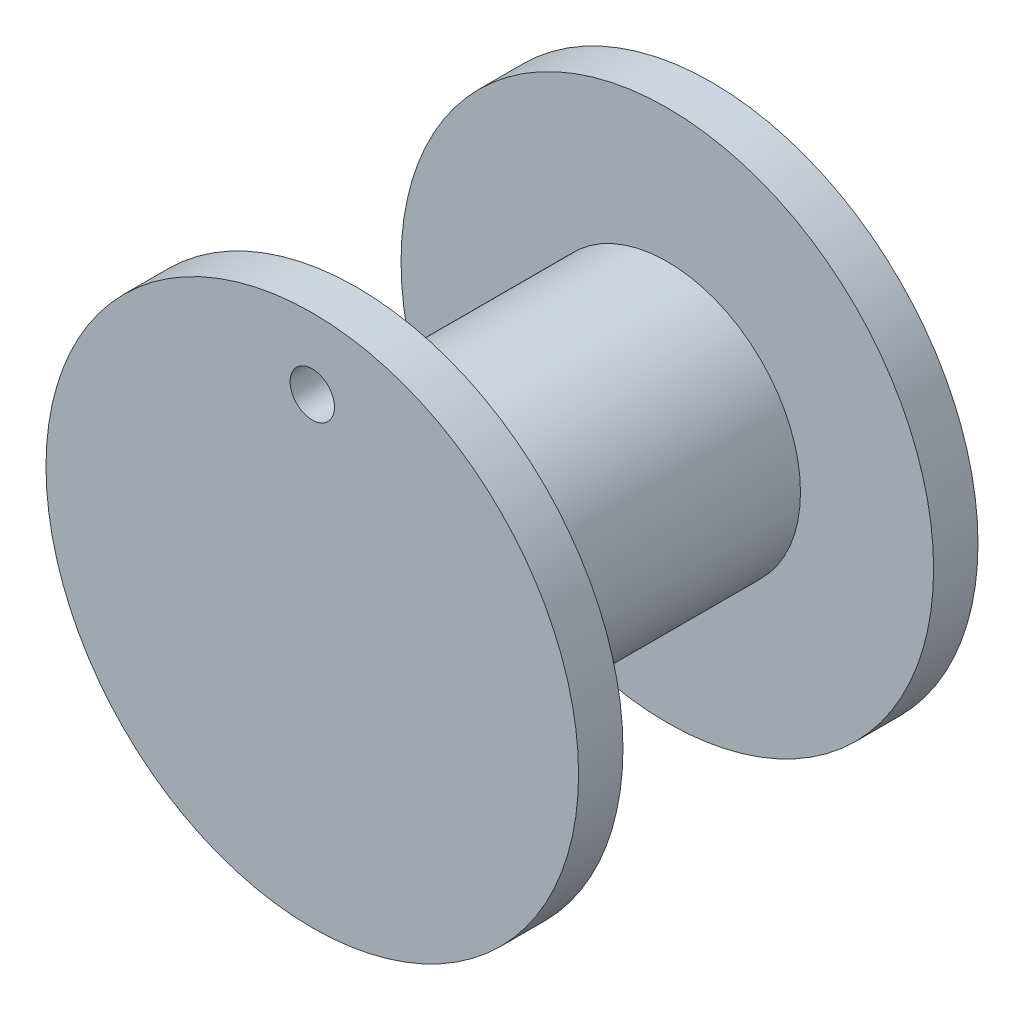
ISO-10303-21;
HEADER;
FILE_DESCRIPTION(('STEP AP214'),'2;1');
FILE_NAME('part.step','',(''),(''),'','','');
FILE_SCHEMA(('AUTOMOTIVE_DESIGN { 1 0 10303 214 1 1 1 1 }'));
ENDSEC;
DATA;
#1=APPLICATION_CONTEXT('core data for automotive mechanical design processes');
#2=APPLICATION_PROTOCOL_DEFINITION('international standard','automotive_design',2000,#1);
#3=PRODUCT_CONTEXT('',#1,'mechanical');
#4=PRODUCT('Part','Part','',(#3));
#5=PRODUCT_RELATED_PRODUCT_CATEGORY('part','',(#4));
#6=PRODUCT_DEFINITION_FORMATION('','',#4);
#7=PRODUCT_DEFINITION_CONTEXT('part definition',#1,'design');
#8=PRODUCT_DEFINITION('design','',#6,#7);
#9=PRODUCT_DEFINITION_SHAPE('','',#8);
#10=(LENGTH_UNIT() NAMED_UNIT(*) SI_UNIT(.MILLI.,.METRE.));
#11=(NAMED_UNIT(*) PLANE_ANGLE_UNIT() SI_UNIT($,.RADIAN.));
#12=(NAMED_UNIT(*) SI_UNIT($,.STERADIAN.) SOLID_ANGLE_UNIT());
#13=UNCERTAINTY_MEASURE_WITH_UNIT(LENGTH_MEASURE(1.E-05),#10,'distance_accuracy_value','');
#14=(GEOMETRIC_REPRESENTATION_CONTEXT(3) GLOBAL_UNCERTAINTY_ASSIGNED_CONTEXT((#13)) GLOBAL_UNIT_ASSIGNED_CONTEXT((#10,
#11,#12)) REPRESENTATION_CONTEXT('',''));
#15=CARTESIAN_POINT('',(0.,0.,0.));
#16=DIRECTION('',(0.,0.,1.));
#17=DIRECTION('',(1.,0.,0.));
#18=AXIS2_PLACEMENT_3D('',#15,#16,#17);
#19=CARTESIAN_POINT('',(0.,0.,3.175));
#20=DIRECTION('',(0.,0.,1.));
#21=DIRECTION('',(1.,0.,0.));
#22=AXIS2_PLACEMENT_3D('',#19,#20,#21);
#23=PLANE('',#22);
#24=CARTESIAN_POINT('',(0.,0.,3.175));
#25=DIRECTION('',(0.,0.,1.));
#26=DIRECTION('',(1.,0.,0.));
#27=AXIS2_PLACEMENT_3D('',#24,#25,#26);
#28=CIRCLE('',#27,19.05);
#29=CARTESIAN_POINT('',(19.05,0.,3.175));
#30=VERTEX_POINT('',#29);
#31=EDGE_CURVE('E11',#30,#30,#28,.T.);
#32=ORIENTED_EDGE('',*,*,#31,.T.);
#33=EDGE_LOOP('',(#32));
#34=FACE_BOUND('',#33,.T.);
#35=CARTESIAN_POINT('',(0.,0.,3.175));
#36=DIRECTION('',(0.,0.,1.));
#37=DIRECTION('',(1.,0.,0.));
#38=AXIS2_PLACEMENT_3D('',#35,#36,#37);
#39=CIRCLE('',#38,9.525);
#40=CARTESIAN_POINT('',(9.525,0.,3.175));
#41=VERTEX_POINT('',#40);
#42=EDGE_CURVE('E124',#41,#41,#39,.T.);
#43=ORIENTED_EDGE('',*,*,#42,.F.);
#44=EDGE_LOOP('',(#43));
#45=FACE_BOUND('',#44,.T.);
#46=ADVANCED_FACE('F33',(#34,#45),#23,.T.);
#47=CARTESIAN_POINT('',(0.,0.,0.));
#48=DIRECTION('',(0.,0.,1.));
#49=DIRECTION('',(1.,0.,0.));
#50=AXIS2_PLACEMENT_3D('',#47,#48,#49);
#51=PLANE('',#50);
#52=CARTESIAN_POINT('',(0.,0.,0.));
#53=DIRECTION('',(0.,0.,1.));
#54=DIRECTION('',(1.,0.,0.));
#55=AXIS2_PLACEMENT_3D('',#52,#53,#54);
#56=CIRCLE('',#55,19.05);
#57=CARTESIAN_POINT('',(19.05,0.,0.));
#58=VERTEX_POINT('',#57);
#59=EDGE_CURVE('E37',#58,#58,#56,.T.);
#60=ORIENTED_EDGE('',*,*,#59,.F.);
#61=EDGE_LOOP('',(#60));
#62=FACE_BOUND('',#61,.T.);
#63=DIRECTION('',(0.5,0.866025403784439,0.));
#64=VECTOR('',#63,1.);
#65=CARTESIAN_POINT('',(3.66617420935412,-6.35,0.));
#66=LINE('',#65,#64);
#67=CARTESIAN_POINT('',(3.66617420935412,-6.35,0.));
#68=VERTEX_POINT('',#67);
#69=CARTESIAN_POINT('',(7.33234841870825,0.,0.));
#70=VERTEX_POINT('',#69);
#71=EDGE_CURVE('E48',#68,#70,#66,.T.);
#72=ORIENTED_EDGE('',*,*,#71,.T.);
#73=DIRECTION('',(-0.5,0.866025403784438,0.));
#74=VECTOR('',#73,1.);
#75=CARTESIAN_POINT('',(7.33234841870825,0.,0.));
#76=LINE('',#75,#74);
#77=CARTESIAN_POINT('',(3.66617420935412,6.35,0.));
#78=VERTEX_POINT('',#77);
#79=EDGE_CURVE('E131',#70,#78,#76,.T.);
#80=ORIENTED_EDGE('',*,*,#79,.T.);
#81=DIRECTION('',(-1.,0.,0.));
#82=VECTOR('',#81,1.);
#83=CARTESIAN_POINT('',(3.66617420935412,6.35,0.));
#84=LINE('',#83,#82);
#85=CARTESIAN_POINT('',(-3.66617420935412,6.35,0.));
#86=VERTEX_POINT('',#85);
#87=EDGE_CURVE('E104',#78,#86,#84,.T.);
#88=ORIENTED_EDGE('',*,*,#87,.T.);
#89=DIRECTION('',(-0.5,-0.866025403784438,0.));
#90=VECTOR('',#89,1.);
#91=CARTESIAN_POINT('',(-3.66617420935412,6.35,0.));
#92=LINE('',#91,#90);
#93=CARTESIAN_POINT('',(-7.33234841870825,0.,0.));
#94=VERTEX_POINT('',#93);
#95=EDGE_CURVE('E134',#86,#94,#92,.T.);
#96=ORIENTED_EDGE('',*,*,#95,.T.);
#97=DIRECTION('',(0.5,-0.866025403784438,0.));
#98=VECTOR('',#97,1.);
#99=CARTESIAN_POINT('',(-7.33234841870825,0.,0.));
#100=LINE('',#99,#98);
#101=CARTESIAN_POINT('',(-3.66617420935412,-6.35,0.));
#102=VERTEX_POINT('',#101);
#103=EDGE_CURVE('E137',#94,#102,#100,.T.);
#104=ORIENTED_EDGE('',*,*,#103,.T.);
#105=DIRECTION('',(1.,0.,0.));
#106=VECTOR('',#105,1.);
#107=CARTESIAN_POINT('',(-3.66617420935412,-6.35,0.));
#108=LINE('',#107,#106);
#109=EDGE_CURVE('E140',#102,#68,#108,.T.);
#110=ORIENTED_EDGE('',*,*,#109,.T.);
#111=EDGE_LOOP('',(#72,#80,#88,#96,#104,#110));
#112=FACE_BOUND('',#111,.T.);
#113=ADVANCED_FACE('F153',(#62,#112),#51,.F.);
#114=CARTESIAN_POINT('',(0.,0.,3.175));
#115=DIRECTION('',(0.,0.,-1.));
#116=DIRECTION('',(-1.,0.,0.));
#117=AXIS2_PLACEMENT_3D('',#114,#115,#116);
#118=CYLINDRICAL_SURFACE('',#117,19.05);
#119=ORIENTED_EDGE('',*,*,#31,.F.);
#120=EDGE_LOOP('',(#119));
#121=FACE_BOUND('',#120,.T.);
#122=ORIENTED_EDGE('',*,*,#59,.T.);
#123=EDGE_LOOP('',(#122));
#124=FACE_BOUND('',#123,.T.);
#125=ADVANCED_FACE('F35',(#121,#124),#118,.T.);
#126=CARTESIAN_POINT('',(3.66617420935412,-6.35,3.175));
#127=DIRECTION('',(-0.866025403784439,0.5,0.));
#128=DIRECTION('',(-0.5,-0.866025403784439,0.));
#129=AXIS2_PLACEMENT_3D('',#126,#127,#128);
#130=PLANE('',#129);
#131=ORIENTED_EDGE('',*,*,#71,.F.);
#132=DIRECTION('',(0.,0.,-1.));
#133=VECTOR('',#132,1.);
#134=CARTESIAN_POINT('',(3.66617420935412,-6.35,3.175));
#135=LINE('',#134,#133);
#136=CARTESIAN_POINT('',(3.6661742093542,-6.34999999999996,25.4));
#137=VERTEX_POINT('',#136);
#138=EDGE_CURVE('E143',#137,#68,#135,.T.);
#139=ORIENTED_EDGE('',*,*,#138,.F.);
#140=DIRECTION('',(0.499999999999995,0.866025403784441,0.));
#141=VECTOR('',#140,1.);
#142=CARTESIAN_POINT('',(3.6661742093542,-6.34999999999996,25.4));
#143=LINE('',#142,#141);
#144=CARTESIAN_POINT('',(7.33234841870825,0.,25.4));
#145=VERTEX_POINT('',#144);
#146=EDGE_CURVE('E112',#137,#145,#143,.T.);
#147=ORIENTED_EDGE('',*,*,#146,.T.);
#148=DIRECTION('',(0.,0.,-1.));
#149=VECTOR('',#148,1.);
#150=CARTESIAN_POINT('',(7.33234841870825,0.,3.175));
#151=LINE('',#150,#149);
#152=EDGE_CURVE('E107',#145,#70,#151,.T.);
#153=ORIENTED_EDGE('',*,*,#152,.T.);
#154=EDGE_LOOP('',(#131,#139,#147,#153));
#155=FACE_BOUND('',#154,.T.);
#156=ADVANCED_FACE('F158',(#155),#130,.T.);
#157=CARTESIAN_POINT('',(7.33234841870825,0.,3.175));
#158=DIRECTION('',(-0.866025403784438,-0.5,0.));
#159=DIRECTION('',(0.5,-0.866025403784438,0.));
#160=AXIS2_PLACEMENT_3D('',#157,#158,#159);
#161=PLANE('',#160);
#162=ORIENTED_EDGE('',*,*,#79,.F.);
#163=ORIENTED_EDGE('',*,*,#152,.F.);
#164=DIRECTION('',(-0.500000000000001,0.866025403784438,0.));
#165=VECTOR('',#164,1.);
#166=CARTESIAN_POINT('',(7.33234841870825,0.,25.4));
#167=LINE('',#166,#165);
#168=CARTESIAN_POINT('',(3.66617420935411,6.35000000000001,25.4));
#169=VERTEX_POINT('',#168);
#170=EDGE_CURVE('E93',#145,#169,#167,.T.);
#171=ORIENTED_EDGE('',*,*,#170,.T.);
#172=DIRECTION('',(0.,0.,-1.));
#173=VECTOR('',#172,1.);
#174=CARTESIAN_POINT('',(3.66617420935412,6.35,3.175));
#175=LINE('',#174,#173);
#176=EDGE_CURVE('E101',#169,#78,#175,.T.);
#177=ORIENTED_EDGE('',*,*,#176,.T.);
#178=EDGE_LOOP('',(#162,#163,#171,#177));
#179=FACE_BOUND('',#178,.T.);
#180=ADVANCED_FACE('F110',(#179),#161,.T.);
#181=CARTESIAN_POINT('',(3.66617420935412,6.35,3.175));
#182=DIRECTION('',(0.,-1.,0.));
#183=DIRECTION('',(0.,0.,-1.));
#184=AXIS2_PLACEMENT_3D('',#181,#182,#183);
#185=PLANE('',#184);
#186=ORIENTED_EDGE('',*,*,#87,.F.);
#187=ORIENTED_EDGE('',*,*,#176,.F.);
#188=DIRECTION('',(-1.,0.,0.));
#189=VECTOR('',#188,1.);
#190=CARTESIAN_POINT('',(3.66617420935411,6.35000000000001,25.4));
#191=LINE('',#190,#189);
#192=CARTESIAN_POINT('',(-3.66617420935415,6.34999999999998,25.4));
#193=VERTEX_POINT('',#192);
#194=EDGE_CURVE('E89',#169,#193,#191,.T.);
#195=ORIENTED_EDGE('',*,*,#194,.T.);
#196=DIRECTION('',(0.,0.,-1.));
#197=VECTOR('',#196,1.);
#198=CARTESIAN_POINT('',(-3.66617420935412,6.35,3.175));
#199=LINE('',#198,#197);
#200=EDGE_CURVE('E108',#193,#86,#199,.T.);
#201=ORIENTED_EDGE('',*,*,#200,.T.);
#202=EDGE_LOOP('',(#186,#187,#195,#201));
#203=FACE_BOUND('',#202,.T.);
#204=ADVANCED_FACE('F102',(#203),#185,.T.);
#205=CARTESIAN_POINT('',(-3.66617420935412,6.35,3.175));
#206=DIRECTION('',(0.866025403784439,-0.5,0.));
#207=DIRECTION('',(0.5,0.866025403784439,0.));
#208=AXIS2_PLACEMENT_3D('',#205,#206,#207);
#209=PLANE('',#208);
#210=ORIENTED_EDGE('',*,*,#95,.F.);
#211=ORIENTED_EDGE('',*,*,#200,.F.);
#212=DIRECTION('',(-0.499999999999995,-0.866025403784441,0.));
#213=VECTOR('',#212,1.);
#214=CARTESIAN_POINT('',(-3.66617420935415,6.34999999999998,25.4));
#215=LINE('',#214,#213);
#216=CARTESIAN_POINT('',(-7.33234841870825,0.,25.4));
#217=VERTEX_POINT('',#216);
#218=EDGE_CURVE('E96',#193,#217,#215,.T.);
#219=ORIENTED_EDGE('',*,*,#218,.T.);
#220=DIRECTION('',(0.,0.,-1.));
#221=VECTOR('',#220,1.);
#222=CARTESIAN_POINT('',(-7.33234841870825,0.,3.175));
#223=LINE('',#222,#221);
#224=EDGE_CURVE('E146',#217,#94,#223,.T.);
#225=ORIENTED_EDGE('',*,*,#224,.T.);
#226=EDGE_LOOP('',(#210,#211,#219,#225));
#227=FACE_BOUND('',#226,.T.);
#228=ADVANCED_FACE('F163',(#227),#209,.T.);
#229=CARTESIAN_POINT('',(-7.33234841870825,0.,3.175));
#230=DIRECTION('',(0.866025403784438,0.5,0.));
#231=DIRECTION('',(-0.5,0.866025403784439,0.));
#232=AXIS2_PLACEMENT_3D('',#229,#230,#231);
#233=PLANE('',#232);
#234=ORIENTED_EDGE('',*,*,#103,.F.);
#235=ORIENTED_EDGE('',*,*,#224,.F.);
#236=DIRECTION('',(0.500000000000007,-0.866025403784435,0.));
#237=VECTOR('',#236,1.);
#238=CARTESIAN_POINT('',(-7.33234841870825,0.,25.4));
#239=LINE('',#238,#237);
#240=CARTESIAN_POINT('',(-3.66617420935406,-6.35000000000004,25.4));
#241=VERTEX_POINT('',#240);
#242=EDGE_CURVE('E119',#217,#241,#239,.T.);
#243=ORIENTED_EDGE('',*,*,#242,.T.);
#244=DIRECTION('',(0.,0.,-1.));
#245=VECTOR('',#244,1.);
#246=CARTESIAN_POINT('',(-3.66617420935412,-6.35,3.175));
#247=LINE('',#246,#245);
#248=EDGE_CURVE('E56',#241,#102,#247,.T.);
#249=ORIENTED_EDGE('',*,*,#248,.T.);
#250=EDGE_LOOP('',(#234,#235,#243,#249));
#251=FACE_BOUND('',#250,.T.);
#252=ADVANCED_FACE('F160',(#251),#233,.T.);
#253=CARTESIAN_POINT('',(-3.66617420935412,-6.35,3.175));
#254=DIRECTION('',(0.,1.,0.));
#255=DIRECTION('',(-1.,0.,0.));
#256=AXIS2_PLACEMENT_3D('',#253,#254,#255);
#257=PLANE('',#256);
#258=ORIENTED_EDGE('',*,*,#109,.F.);
#259=ORIENTED_EDGE('',*,*,#248,.F.);
#260=DIRECTION('',(1.,0.,0.));
#261=VECTOR('',#260,1.);
#262=CARTESIAN_POINT('',(-3.66617420935406,-6.35000000000003,25.4));
#263=LINE('',#262,#261);
#264=EDGE_CURVE('E121',#241,#137,#263,.T.);
#265=ORIENTED_EDGE('',*,*,#264,.T.);
#266=ORIENTED_EDGE('',*,*,#138,.T.);
#267=EDGE_LOOP('',(#258,#259,#265,#266));
#268=FACE_BOUND('',#267,.T.);
#269=ADVANCED_FACE('F157',(#268),#257,.T.);
#270=CARTESIAN_POINT('',(0.,0.,25.4));
#271=DIRECTION('',(0.,0.,-1.));
#272=DIRECTION('',(-1.,0.,0.));
#273=AXIS2_PLACEMENT_3D('',#270,#271,#272);
#274=CYLINDRICAL_SURFACE('',#273,9.525);
#275=CARTESIAN_POINT('',(0.,0.,25.4));
#276=DIRECTION('',(0.,0.,1.));
#277=DIRECTION('',(1.,0.,0.));
#278=AXIS2_PLACEMENT_3D('',#275,#276,#277);
#279=CIRCLE('',#278,9.525);
#280=CARTESIAN_POINT('',(9.525,0.,25.4));
#281=VERTEX_POINT('',#280);
#282=EDGE_CURVE('E125',#281,#281,#279,.T.);
#283=ORIENTED_EDGE('',*,*,#282,.F.);
#284=EDGE_LOOP('',(#283));
#285=FACE_BOUND('',#284,.T.);
#286=ORIENTED_EDGE('',*,*,#42,.T.);
#287=EDGE_LOOP('',(#286));
#288=FACE_BOUND('',#287,.T.);
#289=ADVANCED_FACE('F213',(#285,#288),#274,.T.);
#290=CARTESIAN_POINT('',(0.,0.,25.4));
#291=DIRECTION('',(0.,0.,1.));
#292=DIRECTION('',(1.,0.,0.));
#293=AXIS2_PLACEMENT_3D('',#290,#291,#292);
#294=PLANE('',#293);
#295=ORIENTED_EDGE('',*,*,#170,.F.);
#296=ORIENTED_EDGE('',*,*,#146,.F.);
#297=ORIENTED_EDGE('',*,*,#264,.F.);
#298=ORIENTED_EDGE('',*,*,#242,.F.);
#299=ORIENTED_EDGE('',*,*,#218,.F.);
#300=ORIENTED_EDGE('',*,*,#194,.F.);
#301=EDGE_LOOP('',(#295,#296,#297,#298,#299,#300));
#302=FACE_BOUND('',#301,.T.);
#303=ADVANCED_FACE('F91',(#302),#294,.F.);
#304=CARTESIAN_POINT('',(0.,13.9958029711641,25.4));
#305=DIRECTION('',(0.,0.,1.));
#306=DIRECTION('',(1.,0.,0.));
#307=AXIS2_PLACEMENT_3D('',#304,#305,#306);
#308=CIRCLE('',#307,1.5875);
#309=CARTESIAN_POINT('',(1.5875,13.9958029711641,25.4));
#310=VERTEX_POINT('',#309);
#311=EDGE_CURVE('E322',#310,#310,#308,.T.);
#312=ORIENTED_EDGE('',*,*,#311,.T.);
#313=EDGE_LOOP('',(#312));
#314=FACE_BOUND('',#313,.T.);
#315=CARTESIAN_POINT('',(0.,0.,25.4));
#316=DIRECTION('',(0.,0.,1.));
#317=DIRECTION('',(1.,0.,0.));
#318=AXIS2_PLACEMENT_3D('',#315,#316,#317);
#319=CIRCLE('',#318,19.05);
#320=CARTESIAN_POINT('',(19.05,0.,25.4));
#321=VERTEX_POINT('',#320);
#322=EDGE_CURVE('E324',#321,#321,#319,.T.);
#323=ORIENTED_EDGE('',*,*,#322,.F.);
#324=EDGE_LOOP('',(#323));
#325=FACE_BOUND('',#324,.T.);
#326=ORIENTED_EDGE('',*,*,#282,.T.);
#327=EDGE_LOOP('',(#326));
#328=FACE_BOUND('',#327,.T.);
#329=ADVANCED_FACE('F225',(#314,#325,#328),#294,.F.);
#330=CARTESIAN_POINT('',(0.,0.,28.575));
#331=DIRECTION('',(0.,0.,1.));
#332=DIRECTION('',(1.,0.,0.));
#333=AXIS2_PLACEMENT_3D('',#330,#331,#332);
#334=PLANE('',#333);
#335=CARTESIAN_POINT('',(0.,0.,28.575));
#336=DIRECTION('',(0.,0.,1.));
#337=DIRECTION('',(1.,0.,0.));
#338=AXIS2_PLACEMENT_3D('',#335,#336,#337);
#339=CIRCLE('',#338,19.05);
#340=CARTESIAN_POINT('',(19.05,0.,28.575));
#341=VERTEX_POINT('',#340);
#342=EDGE_CURVE('E114',#341,#341,#339,.T.);
#343=ORIENTED_EDGE('',*,*,#342,.T.);
#344=EDGE_LOOP('',(#343));
#345=FACE_BOUND('',#344,.T.);
#346=CARTESIAN_POINT('',(0.,13.9958029711641,28.575));
#347=DIRECTION('',(0.,0.,1.));
#348=DIRECTION('',(1.,0.,0.));
#349=AXIS2_PLACEMENT_3D('',#346,#347,#348);
#350=CIRCLE('',#349,1.5875);
#351=CARTESIAN_POINT('',(1.5875,13.9958029711641,28.575));
#352=VERTEX_POINT('',#351);
#353=EDGE_CURVE('E319',#352,#352,#350,.T.);
#354=ORIENTED_EDGE('',*,*,#353,.F.);
#355=EDGE_LOOP('',(#354));
#356=FACE_BOUND('',#355,.T.);
#357=ADVANCED_FACE('F234',(#345,#356),#334,.T.);
#358=CARTESIAN_POINT('',(0.,0.,28.575));
#359=DIRECTION('',(0.,0.,-1.));
#360=DIRECTION('',(-1.,0.,0.));
#361=AXIS2_PLACEMENT_3D('',#358,#359,#360);
#362=CYLINDRICAL_SURFACE('',#361,19.05);
#363=ORIENTED_EDGE('',*,*,#342,.F.);
#364=EDGE_LOOP('',(#363));
#365=FACE_BOUND('',#364,.T.);
#366=ORIENTED_EDGE('',*,*,#322,.T.);
#367=EDGE_LOOP('',(#366));
#368=FACE_BOUND('',#367,.T.);
#369=ADVANCED_FACE('F243',(#365,#368),#362,.T.);
#370=CARTESIAN_POINT('',(0.,13.9958029711641,28.575));
#371=DIRECTION('',(0.,0.,-1.));
#372=DIRECTION('',(-1.,0.,0.));
#373=AXIS2_PLACEMENT_3D('',#370,#371,#372);
#374=CYLINDRICAL_SURFACE('',#373,1.5875);
#375=ORIENTED_EDGE('',*,*,#353,.T.);
#376=EDGE_LOOP('',(#375));
#377=FACE_BOUND('',#376,.T.);
#378=ORIENTED_EDGE('',*,*,#311,.F.);
#379=EDGE_LOOP('',(#378));
#380=FACE_BOUND('',#379,.T.);
#381=ADVANCED_FACE('F253',(#377,#380),#374,.F.);
#382=CLOSED_SHELL('',(#46,#113,#125,#156,#180,#204,#228,#252,#269,#289,#303,#329,#357,#369,#381));
#383=MANIFOLD_SOLID_BREP('B2',#382);
#384=ADVANCED_BREP_SHAPE_REPRESENTATION('',(#18,#383),#14);
#385=SHAPE_DEFINITION_REPRESENTATION(#9,#384);
ENDSEC;
END-ISO-10303-21;
